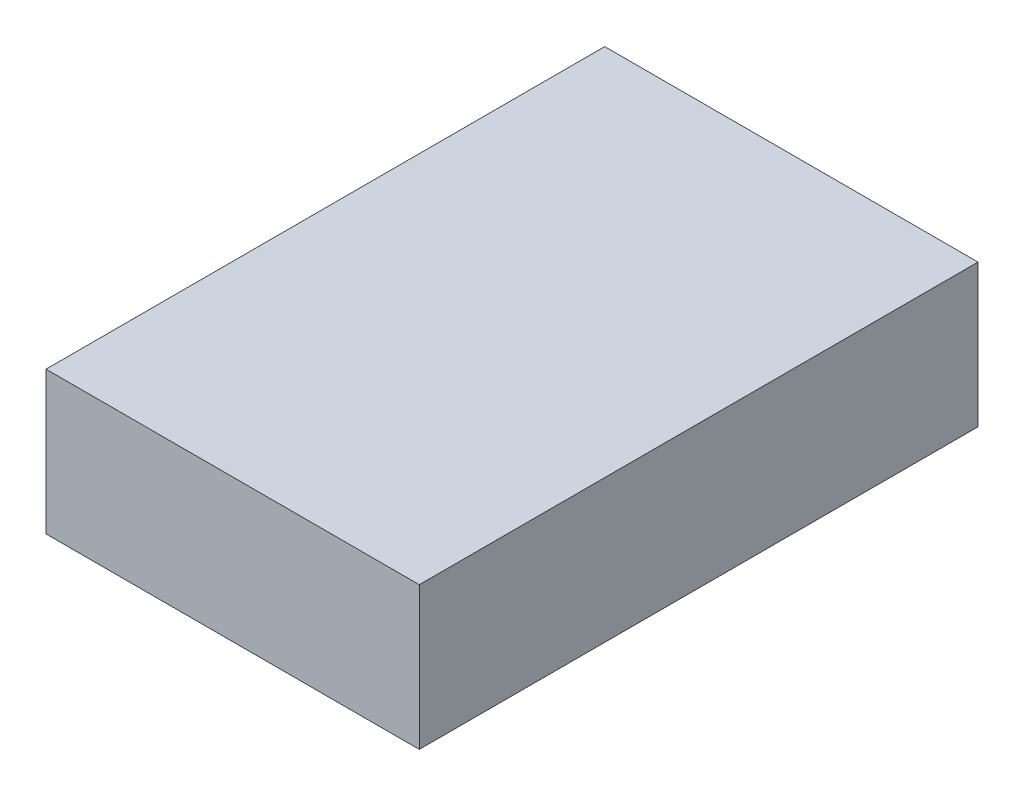
ISO-10303-21;
HEADER;
FILE_DESCRIPTION(('STEP AP214'),'2;1');
FILE_NAME('part.step','',(''),(''),'','','');
FILE_SCHEMA(('AUTOMOTIVE_DESIGN { 1 0 10303 214 1 1 1 1 }'));
ENDSEC;
DATA;
#1=APPLICATION_CONTEXT('core data for automotive mechanical design processes');
#2=APPLICATION_PROTOCOL_DEFINITION('international standard','automotive_design',2000,#1);
#3=PRODUCT_CONTEXT('',#1,'mechanical');
#4=PRODUCT('Part','Part','',(#3));
#5=PRODUCT_RELATED_PRODUCT_CATEGORY('part','',(#4));
#6=PRODUCT_DEFINITION_FORMATION('','',#4);
#7=PRODUCT_DEFINITION_CONTEXT('part definition',#1,'design');
#8=PRODUCT_DEFINITION('design','',#6,#7);
#9=PRODUCT_DEFINITION_SHAPE('','',#8);
#10=(LENGTH_UNIT() NAMED_UNIT(*) SI_UNIT(.MILLI.,.METRE.));
#11=(NAMED_UNIT(*) PLANE_ANGLE_UNIT() SI_UNIT($,.RADIAN.));
#12=(NAMED_UNIT(*) SI_UNIT($,.STERADIAN.) SOLID_ANGLE_UNIT());
#13=UNCERTAINTY_MEASURE_WITH_UNIT(LENGTH_MEASURE(1.E-05),#10,'distance_accuracy_value','');
#14=(GEOMETRIC_REPRESENTATION_CONTEXT(3) GLOBAL_UNCERTAINTY_ASSIGNED_CONTEXT((#13)) GLOBAL_UNIT_ASSIGNED_CONTEXT((#10,
#11,#12)) REPRESENTATION_CONTEXT('',''));
#15=CARTESIAN_POINT('',(0.,0.,0.));
#16=DIRECTION('',(0.,0.,1.));
#17=DIRECTION('',(1.,0.,0.));
#18=AXIS2_PLACEMENT_3D('',#15,#16,#17);
#19=CARTESIAN_POINT('',(19.939,15.24,29.845));
#20=DIRECTION('',(-1.,0.,0.));
#21=DIRECTION('',(0.,0.,1.));
#22=AXIS2_PLACEMENT_3D('',#19,#20,#21);
#23=PLANE('',#22);
#24=DIRECTION('',(0.,0.,-1.));
#25=VECTOR('',#24,1.);
#26=CARTESIAN_POINT('',(19.939,0.,29.845));
#27=LINE('',#26,#25);
#28=CARTESIAN_POINT('',(19.939,0.,29.845));
#29=VERTEX_POINT('',#28);
#30=CARTESIAN_POINT('',(19.939,0.,-29.845));
#31=VERTEX_POINT('',#30);
#32=EDGE_CURVE('E91',#29,#31,#27,.T.);
#33=ORIENTED_EDGE('',*,*,#32,.T.);
#34=DIRECTION('',(0.,-1.,0.));
#35=VECTOR('',#34,1.);
#36=CARTESIAN_POINT('',(19.939,15.24,-29.845));
#37=LINE('',#36,#35);
#38=CARTESIAN_POINT('',(19.939,15.24,-29.845));
#39=VERTEX_POINT('',#38);
#40=EDGE_CURVE('E11',#39,#31,#37,.T.);
#41=ORIENTED_EDGE('',*,*,#40,.F.);
#42=DIRECTION('',(0.,0.,-1.));
#43=VECTOR('',#42,1.);
#44=CARTESIAN_POINT('',(19.939,15.24,29.845));
#45=LINE('',#44,#43);
#46=CARTESIAN_POINT('',(19.939,15.24,29.845));
#47=VERTEX_POINT('',#46);
#48=EDGE_CURVE('E79',#47,#39,#45,.T.);
#49=ORIENTED_EDGE('',*,*,#48,.F.);
#50=DIRECTION('',(0.,-1.,0.));
#51=VECTOR('',#50,1.);
#52=CARTESIAN_POINT('',(19.939,15.24,29.845));
#53=LINE('',#52,#51);
#54=EDGE_CURVE('E87',#47,#29,#53,.T.);
#55=ORIENTED_EDGE('',*,*,#54,.T.);
#56=EDGE_LOOP('',(#33,#41,#49,#55));
#57=FACE_BOUND('',#56,.T.);
#58=ADVANCED_FACE('F28',(#57),#23,.F.);
#59=CARTESIAN_POINT('',(-19.939,15.24,-29.845));
#60=DIRECTION('',(0.,0.,1.));
#61=DIRECTION('',(1.,0.,0.));
#62=AXIS2_PLACEMENT_3D('',#59,#60,#61);
#63=PLANE('',#62);
#64=DIRECTION('',(-1.,0.,0.));
#65=VECTOR('',#64,1.);
#66=CARTESIAN_POINT('',(-19.939,0.,-29.845));
#67=LINE('',#66,#65);
#68=CARTESIAN_POINT('',(-19.939,0.,-29.845));
#69=VERTEX_POINT('',#68);
#70=EDGE_CURVE('E83',#31,#69,#67,.T.);
#71=ORIENTED_EDGE('',*,*,#70,.T.);
#72=DIRECTION('',(0.,-1.,0.));
#73=VECTOR('',#72,1.);
#74=CARTESIAN_POINT('',(-19.939,15.24,-29.845));
#75=LINE('',#74,#73);
#76=CARTESIAN_POINT('',(-19.939,15.24,-29.845));
#77=VERTEX_POINT('',#76);
#78=EDGE_CURVE('E36',#77,#69,#75,.T.);
#79=ORIENTED_EDGE('',*,*,#78,.F.);
#80=DIRECTION('',(-1.,0.,0.));
#81=VECTOR('',#80,1.);
#82=CARTESIAN_POINT('',(-19.939,15.24,-29.845));
#83=LINE('',#82,#81);
#84=EDGE_CURVE('E74',#39,#77,#83,.T.);
#85=ORIENTED_EDGE('',*,*,#84,.F.);
#86=ORIENTED_EDGE('',*,*,#40,.T.);
#87=EDGE_LOOP('',(#71,#79,#85,#86));
#88=FACE_BOUND('',#87,.T.);
#89=ADVANCED_FACE('F82',(#88),#63,.F.);
#90=CARTESIAN_POINT('',(-19.939,15.24,29.845));
#91=DIRECTION('',(1.,0.,0.));
#92=DIRECTION('',(0.,0.,-1.));
#93=AXIS2_PLACEMENT_3D('',#90,#91,#92);
#94=PLANE('',#93);
#95=DIRECTION('',(0.,0.,1.));
#96=VECTOR('',#95,1.);
#97=CARTESIAN_POINT('',(-19.939,0.,29.845));
#98=LINE('',#97,#96);
#99=CARTESIAN_POINT('',(-19.939,0.,29.845));
#100=VERTEX_POINT('',#99);
#101=EDGE_CURVE('E61',#69,#100,#98,.T.);
#102=ORIENTED_EDGE('',*,*,#101,.T.);
#103=DIRECTION('',(0.,-1.,0.));
#104=VECTOR('',#103,1.);
#105=CARTESIAN_POINT('',(-19.939,15.24,29.845));
#106=LINE('',#105,#104);
#107=CARTESIAN_POINT('',(-19.939,15.24,29.845));
#108=VERTEX_POINT('',#107);
#109=EDGE_CURVE('E84',#108,#100,#106,.T.);
#110=ORIENTED_EDGE('',*,*,#109,.F.);
#111=DIRECTION('',(0.,0.,1.));
#112=VECTOR('',#111,1.);
#113=CARTESIAN_POINT('',(-19.939,15.24,29.845));
#114=LINE('',#113,#112);
#115=EDGE_CURVE('E77',#77,#108,#114,.T.);
#116=ORIENTED_EDGE('',*,*,#115,.F.);
#117=ORIENTED_EDGE('',*,*,#78,.T.);
#118=EDGE_LOOP('',(#102,#110,#116,#117));
#119=FACE_BOUND('',#118,.T.);
#120=ADVANCED_FACE('F85',(#119),#94,.F.);
#121=CARTESIAN_POINT('',(-19.939,15.24,29.845));
#122=DIRECTION('',(0.,0.,-1.));
#123=DIRECTION('',(-1.,0.,0.));
#124=AXIS2_PLACEMENT_3D('',#121,#122,#123);
#125=PLANE('',#124);
#126=DIRECTION('',(1.,0.,0.));
#127=VECTOR('',#126,1.);
#128=CARTESIAN_POINT('',(-19.939,0.,29.845));
#129=LINE('',#128,#127);
#130=EDGE_CURVE('E67',#100,#29,#129,.T.);
#131=ORIENTED_EDGE('',*,*,#130,.T.);
#132=ORIENTED_EDGE('',*,*,#54,.F.);
#133=DIRECTION('',(1.,0.,0.));
#134=VECTOR('',#133,1.);
#135=CARTESIAN_POINT('',(-19.939,15.24,29.845));
#136=LINE('',#135,#134);
#137=EDGE_CURVE('E44',#108,#47,#136,.T.);
#138=ORIENTED_EDGE('',*,*,#137,.F.);
#139=ORIENTED_EDGE('',*,*,#109,.T.);
#140=EDGE_LOOP('',(#131,#132,#138,#139));
#141=FACE_BOUND('',#140,.T.);
#142=ADVANCED_FACE('F98',(#141),#125,.F.);
#143=CARTESIAN_POINT('',(0.,15.24,0.));
#144=DIRECTION('',(0.,-1.,0.));
#145=DIRECTION('',(0.,0.,-1.));
#146=AXIS2_PLACEMENT_3D('',#143,#144,#145);
#147=PLANE('',#146);
#148=ORIENTED_EDGE('',*,*,#48,.T.);
#149=ORIENTED_EDGE('',*,*,#84,.T.);
#150=ORIENTED_EDGE('',*,*,#115,.T.);
#151=ORIENTED_EDGE('',*,*,#137,.T.);
#152=EDGE_LOOP('',(#148,#149,#150,#151));
#153=FACE_BOUND('',#152,.T.);
#154=ADVANCED_FACE('F75',(#153),#147,.F.);
#155=CARTESIAN_POINT('',(0.,0.,0.));
#156=DIRECTION('',(0.,-1.,0.));
#157=DIRECTION('',(0.,0.,-1.));
#158=AXIS2_PLACEMENT_3D('',#155,#156,#157);
#159=PLANE('',#158);
#160=ORIENTED_EDGE('',*,*,#32,.F.);
#161=ORIENTED_EDGE('',*,*,#130,.F.);
#162=ORIENTED_EDGE('',*,*,#101,.F.);
#163=ORIENTED_EDGE('',*,*,#70,.F.);
#164=EDGE_LOOP('',(#160,#161,#162,#163));
#165=FACE_BOUND('',#164,.T.);
#166=ADVANCED_FACE('F101',(#165),#159,.T.);
#167=CLOSED_SHELL('',(#58,#89,#120,#142,#154,#166));
#168=MANIFOLD_SOLID_BREP('B2',#167);
#169=ADVANCED_BREP_SHAPE_REPRESENTATION('',(#18,#168),#14);
#170=SHAPE_DEFINITION_REPRESENTATION(#9,#169);
ENDSEC;
END-ISO-10303-21;
